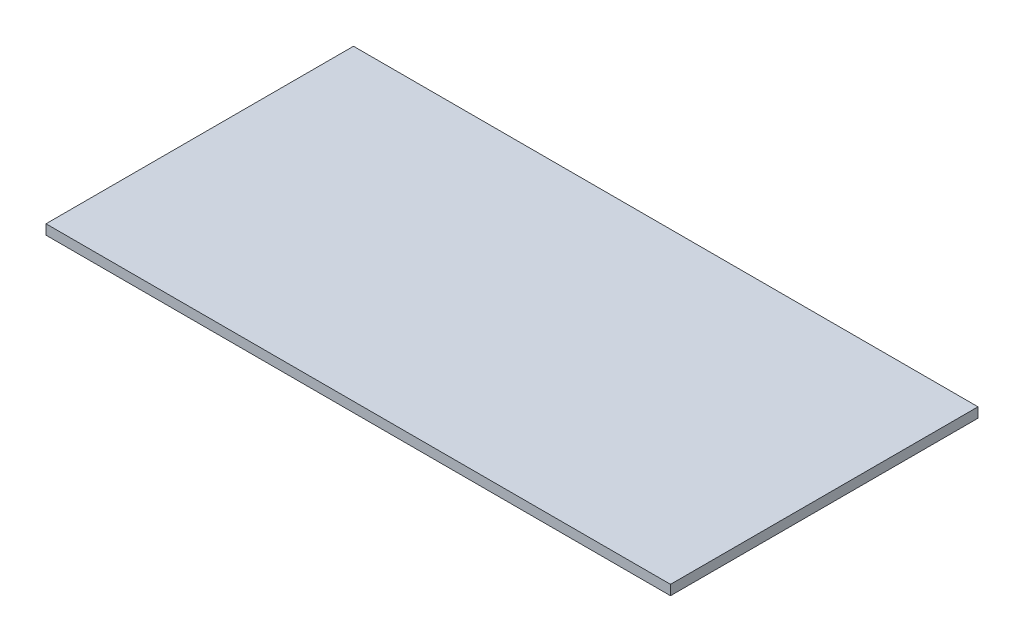
ISO-10303-21;
HEADER;
FILE_DESCRIPTION(('STEP AP214'),'2;1');
FILE_NAME('part.step','',(''),(''),'','','');
FILE_SCHEMA(('AUTOMOTIVE_DESIGN { 1 0 10303 214 1 1 1 1 }'));
ENDSEC;
DATA;
#1=APPLICATION_CONTEXT('core data for automotive mechanical design processes');
#2=APPLICATION_PROTOCOL_DEFINITION('international standard','automotive_design',2000,#1);
#3=PRODUCT_CONTEXT('',#1,'mechanical');
#4=PRODUCT('Part','Part','',(#3));
#5=PRODUCT_RELATED_PRODUCT_CATEGORY('part','',(#4));
#6=PRODUCT_DEFINITION_FORMATION('','',#4);
#7=PRODUCT_DEFINITION_CONTEXT('part definition',#1,'design');
#8=PRODUCT_DEFINITION('design','',#6,#7);
#9=PRODUCT_DEFINITION_SHAPE('','',#8);
#10=(LENGTH_UNIT() NAMED_UNIT(*) SI_UNIT(.MILLI.,.METRE.));
#11=(NAMED_UNIT(*) PLANE_ANGLE_UNIT() SI_UNIT($,.RADIAN.));
#12=(NAMED_UNIT(*) SI_UNIT($,.STERADIAN.) SOLID_ANGLE_UNIT());
#13=UNCERTAINTY_MEASURE_WITH_UNIT(LENGTH_MEASURE(1.E-05),#10,'distance_accuracy_value','');
#14=(GEOMETRIC_REPRESENTATION_CONTEXT(3) GLOBAL_UNCERTAINTY_ASSIGNED_CONTEXT((#13)) GLOBAL_UNIT_ASSIGNED_CONTEXT((#10,
#11,#12)) REPRESENTATION_CONTEXT('',''));
#15=CARTESIAN_POINT('',(0.,0.,0.));
#16=DIRECTION('',(0.,0.,1.));
#17=DIRECTION('',(1.,0.,0.));
#18=AXIS2_PLACEMENT_3D('',#15,#16,#17);
#19=CARTESIAN_POINT('',(63.,2.,31.02));
#20=DIRECTION('',(-1.,0.,0.));
#21=DIRECTION('',(0.,0.,1.));
#22=AXIS2_PLACEMENT_3D('',#19,#20,#21);
#23=PLANE('',#22);
#24=DIRECTION('',(0.,0.,-1.));
#25=VECTOR('',#24,1.);
#26=CARTESIAN_POINT('',(63.,0.,31.02));
#27=LINE('',#26,#25);
#28=CARTESIAN_POINT('',(63.,0.,31.02));
#29=VERTEX_POINT('',#28);
#30=CARTESIAN_POINT('',(63.,0.,-31.02));
#31=VERTEX_POINT('',#30);
#32=EDGE_CURVE('E96',#29,#31,#27,.T.);
#33=ORIENTED_EDGE('',*,*,#32,.T.);
#34=DIRECTION('',(0.,-1.,0.));
#35=VECTOR('',#34,1.);
#36=CARTESIAN_POINT('',(63.,2.,-31.02));
#37=LINE('',#36,#35);
#38=CARTESIAN_POINT('',(63.,2.,-31.02));
#39=VERTEX_POINT('',#38);
#40=EDGE_CURVE('E11',#39,#31,#37,.T.);
#41=ORIENTED_EDGE('',*,*,#40,.F.);
#42=DIRECTION('',(0.,0.,-1.));
#43=VECTOR('',#42,1.);
#44=CARTESIAN_POINT('',(63.,2.,31.02));
#45=LINE('',#44,#43);
#46=CARTESIAN_POINT('',(63.,2.,31.02));
#47=VERTEX_POINT('',#46);
#48=EDGE_CURVE('E84',#47,#39,#45,.T.);
#49=ORIENTED_EDGE('',*,*,#48,.F.);
#50=DIRECTION('',(0.,-1.,0.));
#51=VECTOR('',#50,1.);
#52=CARTESIAN_POINT('',(63.,2.,31.02));
#53=LINE('',#52,#51);
#54=EDGE_CURVE('E92',#47,#29,#53,.T.);
#55=ORIENTED_EDGE('',*,*,#54,.T.);
#56=EDGE_LOOP('',(#33,#41,#49,#55));
#57=FACE_BOUND('',#56,.T.);
#58=ADVANCED_FACE('F33',(#57),#23,.F.);
#59=CARTESIAN_POINT('',(-63.,2.,-31.02));
#60=DIRECTION('',(0.,0.,1.));
#61=DIRECTION('',(1.,0.,0.));
#62=AXIS2_PLACEMENT_3D('',#59,#60,#61);
#63=PLANE('',#62);
#64=DIRECTION('',(-1.,0.,0.));
#65=VECTOR('',#64,1.);
#66=CARTESIAN_POINT('',(-63.,0.,-31.02));
#67=LINE('',#66,#65);
#68=CARTESIAN_POINT('',(-63.,0.,-31.02));
#69=VERTEX_POINT('',#68);
#70=EDGE_CURVE('E88',#31,#69,#67,.T.);
#71=ORIENTED_EDGE('',*,*,#70,.T.);
#72=DIRECTION('',(0.,-1.,0.));
#73=VECTOR('',#72,1.);
#74=CARTESIAN_POINT('',(-63.,2.,-31.02));
#75=LINE('',#74,#73);
#76=CARTESIAN_POINT('',(-63.,2.,-31.02));
#77=VERTEX_POINT('',#76);
#78=EDGE_CURVE('E41',#77,#69,#75,.T.);
#79=ORIENTED_EDGE('',*,*,#78,.F.);
#80=DIRECTION('',(-1.,0.,0.));
#81=VECTOR('',#80,1.);
#82=CARTESIAN_POINT('',(-63.,2.,-31.02));
#83=LINE('',#82,#81);
#84=EDGE_CURVE('E79',#39,#77,#83,.T.);
#85=ORIENTED_EDGE('',*,*,#84,.F.);
#86=ORIENTED_EDGE('',*,*,#40,.T.);
#87=EDGE_LOOP('',(#71,#79,#85,#86));
#88=FACE_BOUND('',#87,.T.);
#89=ADVANCED_FACE('F87',(#88),#63,.F.);
#90=CARTESIAN_POINT('',(-63.,2.,31.02));
#91=DIRECTION('',(1.,0.,0.));
#92=DIRECTION('',(0.,0.,-1.));
#93=AXIS2_PLACEMENT_3D('',#90,#91,#92);
#94=PLANE('',#93);
#95=DIRECTION('',(0.,0.,1.));
#96=VECTOR('',#95,1.);
#97=CARTESIAN_POINT('',(-63.,0.,31.02));
#98=LINE('',#97,#96);
#99=CARTESIAN_POINT('',(-63.,0.,31.02));
#100=VERTEX_POINT('',#99);
#101=EDGE_CURVE('E66',#69,#100,#98,.T.);
#102=ORIENTED_EDGE('',*,*,#101,.T.);
#103=DIRECTION('',(0.,-1.,0.));
#104=VECTOR('',#103,1.);
#105=CARTESIAN_POINT('',(-63.,2.,31.02));
#106=LINE('',#105,#104);
#107=CARTESIAN_POINT('',(-63.,2.,31.02));
#108=VERTEX_POINT('',#107);
#109=EDGE_CURVE('E89',#108,#100,#106,.T.);
#110=ORIENTED_EDGE('',*,*,#109,.F.);
#111=DIRECTION('',(0.,0.,1.));
#112=VECTOR('',#111,1.);
#113=CARTESIAN_POINT('',(-63.,2.,31.02));
#114=LINE('',#113,#112);
#115=EDGE_CURVE('E82',#77,#108,#114,.T.);
#116=ORIENTED_EDGE('',*,*,#115,.F.);
#117=ORIENTED_EDGE('',*,*,#78,.T.);
#118=EDGE_LOOP('',(#102,#110,#116,#117));
#119=FACE_BOUND('',#118,.T.);
#120=ADVANCED_FACE('F90',(#119),#94,.F.);
#121=CARTESIAN_POINT('',(-63.,2.,31.02));
#122=DIRECTION('',(0.,0.,-1.));
#123=DIRECTION('',(-1.,0.,0.));
#124=AXIS2_PLACEMENT_3D('',#121,#122,#123);
#125=PLANE('',#124);
#126=DIRECTION('',(1.,0.,0.));
#127=VECTOR('',#126,1.);
#128=CARTESIAN_POINT('',(-63.,0.,31.02));
#129=LINE('',#128,#127);
#130=EDGE_CURVE('E72',#100,#29,#129,.T.);
#131=ORIENTED_EDGE('',*,*,#130,.T.);
#132=ORIENTED_EDGE('',*,*,#54,.F.);
#133=DIRECTION('',(1.,0.,0.));
#134=VECTOR('',#133,1.);
#135=CARTESIAN_POINT('',(-63.,2.,31.02));
#136=LINE('',#135,#134);
#137=EDGE_CURVE('E49',#108,#47,#136,.T.);
#138=ORIENTED_EDGE('',*,*,#137,.F.);
#139=ORIENTED_EDGE('',*,*,#109,.T.);
#140=EDGE_LOOP('',(#131,#132,#138,#139));
#141=FACE_BOUND('',#140,.T.);
#142=ADVANCED_FACE('F103',(#141),#125,.F.);
#143=CARTESIAN_POINT('',(0.,2.,0.));
#144=DIRECTION('',(0.,-1.,0.));
#145=DIRECTION('',(0.,0.,-1.));
#146=AXIS2_PLACEMENT_3D('',#143,#144,#145);
#147=PLANE('',#146);
#148=ORIENTED_EDGE('',*,*,#48,.T.);
#149=ORIENTED_EDGE('',*,*,#84,.T.);
#150=ORIENTED_EDGE('',*,*,#115,.T.);
#151=ORIENTED_EDGE('',*,*,#137,.T.);
#152=EDGE_LOOP('',(#148,#149,#150,#151));
#153=FACE_BOUND('',#152,.T.);
#154=ADVANCED_FACE('F80',(#153),#147,.F.);
#155=CARTESIAN_POINT('',(0.,0.,0.));
#156=DIRECTION('',(0.,-1.,0.));
#157=DIRECTION('',(0.,0.,-1.));
#158=AXIS2_PLACEMENT_3D('',#155,#156,#157);
#159=PLANE('',#158);
#160=ORIENTED_EDGE('',*,*,#32,.F.);
#161=ORIENTED_EDGE('',*,*,#130,.F.);
#162=ORIENTED_EDGE('',*,*,#101,.F.);
#163=ORIENTED_EDGE('',*,*,#70,.F.);
#164=EDGE_LOOP('',(#160,#161,#162,#163));
#165=FACE_BOUND('',#164,.T.);
#166=ADVANCED_FACE('F106',(#165),#159,.T.);
#167=CLOSED_SHELL('',(#58,#89,#120,#142,#154,#166));
#168=MANIFOLD_SOLID_BREP('B2',#167);
#169=ADVANCED_BREP_SHAPE_REPRESENTATION('',(#18,#168),#14);
#170=SHAPE_DEFINITION_REPRESENTATION(#9,#169);
ENDSEC;
END-ISO-10303-21;
